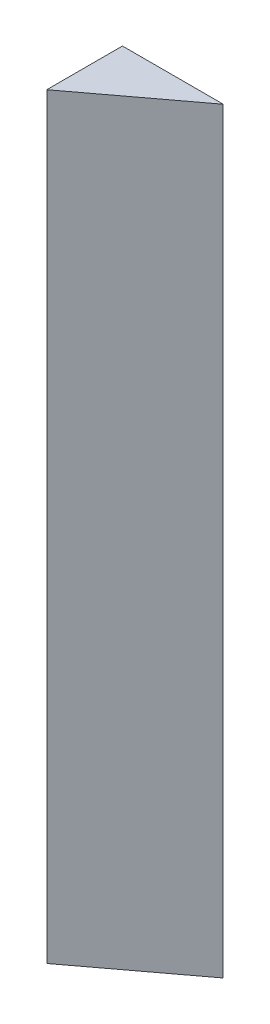
ISO-10303-21;
HEADER;
FILE_DESCRIPTION(('STEP AP214'),'2;1');
FILE_NAME('part.step','',(''),(''),'','','');
FILE_SCHEMA(('AUTOMOTIVE_DESIGN { 1 0 10303 214 1 1 1 1 }'));
ENDSEC;
DATA;
#1=APPLICATION_CONTEXT('core data for automotive mechanical design processes');
#2=APPLICATION_PROTOCOL_DEFINITION('international standard','automotive_design',2000,#1);
#3=PRODUCT_CONTEXT('',#1,'mechanical');
#4=PRODUCT('Part','Part','',(#3));
#5=PRODUCT_RELATED_PRODUCT_CATEGORY('part','',(#4));
#6=PRODUCT_DEFINITION_FORMATION('','',#4);
#7=PRODUCT_DEFINITION_CONTEXT('part definition',#1,'design');
#8=PRODUCT_DEFINITION('design','',#6,#7);
#9=PRODUCT_DEFINITION_SHAPE('','',#8);
#10=(LENGTH_UNIT() NAMED_UNIT(*) SI_UNIT(.MILLI.,.METRE.));
#11=(NAMED_UNIT(*) PLANE_ANGLE_UNIT() SI_UNIT($,.RADIAN.));
#12=(NAMED_UNIT(*) SI_UNIT($,.STERADIAN.) SOLID_ANGLE_UNIT());
#13=UNCERTAINTY_MEASURE_WITH_UNIT(LENGTH_MEASURE(1.E-05),#10,'distance_accuracy_value','');
#14=(GEOMETRIC_REPRESENTATION_CONTEXT(3) GLOBAL_UNCERTAINTY_ASSIGNED_CONTEXT((#13)) GLOBAL_UNIT_ASSIGNED_CONTEXT((#10,
#11,#12)) REPRESENTATION_CONTEXT('',''));
#15=CARTESIAN_POINT('',(0.,0.,0.));
#16=DIRECTION('',(0.,0.,1.));
#17=DIRECTION('',(1.,0.,0.));
#18=AXIS2_PLACEMENT_3D('',#15,#16,#17);
#19=CARTESIAN_POINT('',(-3.906661108733,-0.750000296654108,-2.35778269529518));
#20=DIRECTION('',(0.,-1.,-8.74227765734759E-08));
#21=DIRECTION('',(1.,0.,0.));
#22=AXIS2_PLACEMENT_3D('',#19,#20,#21);
#23=PLANE('',#22);
#24=DIRECTION('',(1.,0.,0.));
#25=VECTOR('',#24,1.);
#26=CARTESIAN_POINT('',(-3.9,-0.75000029723644,-2.35112158656318));
#27=LINE('',#26,#25);
#28=CARTESIAN_POINT('',(-3.9,-0.75000029723844,-2.35112158656318));
#29=VERTEX_POINT('',#28);
#30=CARTESIAN_POINT('',(-3.766777825356,-0.75000029723844,-2.35112158656318));
#31=VERTEX_POINT('',#30);
#32=EDGE_CURVE('E11',#29,#31,#27,.T.);
#33=ORIENTED_EDGE('',*,*,#32,.F.);
#34=DIRECTION('',(0.,8.74227767955204E-08,-0.999999999999996));
#35=VECTOR('',#34,1.);
#36=CARTESIAN_POINT('',(-3.9,-0.750000305978718,-2.25112158656318));
#37=LINE('',#36,#35);
#38=CARTESIAN_POINT('',(-3.9,-0.750000305980718,-2.25112158656318));
#39=VERTEX_POINT('',#38);
#40=EDGE_CURVE('E63',#39,#29,#37,.T.);
#41=ORIENTED_EDGE('',*,*,#40,.F.);
#42=DIRECTION('',(-0.799759704949036,-5.24816640793063E-08,0.600320259811234));
#43=VECTOR('',#42,1.);
#44=CARTESIAN_POINT('',(-3.766777825356,-0.75000029723644,-2.35112158656318));
#45=LINE('',#44,#43);
#46=EDGE_CURVE('E70',#31,#39,#45,.T.);
#47=ORIENTED_EDGE('',*,*,#46,.F.);
#48=EDGE_LOOP('',(#33,#41,#47));
#49=FACE_BOUND('',#48,.T.);
#50=ADVANCED_FACE('F17',(#49),#23,.F.);
#51=CARTESIAN_POINT('',(-3.906661108733,-1.75000029665511,-2.35778278271795));
#52=DIRECTION('',(0.,-1.,-8.74227765734759E-08));
#53=DIRECTION('',(1.,0.,0.));
#54=AXIS2_PLACEMENT_3D('',#51,#52,#53);
#55=PLANE('',#54);
#56=DIRECTION('',(-0.799759704949036,-5.24816634128169E-08,0.600320259811234));
#57=VECTOR('',#56,1.);
#58=CARTESIAN_POINT('',(-3.766777825356,-1.75000029723744,-2.35112167398595));
#59=LINE('',#58,#57);
#60=CARTESIAN_POINT('',(-3.766777825356,-1.75000029723644,-2.35112167398595));
#61=VERTEX_POINT('',#60);
#62=CARTESIAN_POINT('',(-3.9,-1.75000030597872,-2.25112167398595));
#63=VERTEX_POINT('',#62);
#64=EDGE_CURVE('E24',#61,#63,#59,.T.);
#65=ORIENTED_EDGE('',*,*,#64,.T.);
#66=DIRECTION('',(0.,8.7422775685297E-08,-0.999999999999996));
#67=VECTOR('',#66,1.);
#68=CARTESIAN_POINT('',(-3.9,-1.75000030597972,-2.25112167398595));
#69=LINE('',#68,#67);
#70=CARTESIAN_POINT('',(-3.9,-1.75000029723644,-2.35112167398595));
#71=VERTEX_POINT('',#70);
#72=EDGE_CURVE('E49',#63,#71,#69,.T.);
#73=ORIENTED_EDGE('',*,*,#72,.T.);
#74=DIRECTION('',(1.,0.,0.));
#75=VECTOR('',#74,1.);
#76=CARTESIAN_POINT('',(-3.9,-1.75000029723744,-2.35112167398595));
#77=LINE('',#76,#75);
#78=EDGE_CURVE('E46',#71,#61,#77,.T.);
#79=ORIENTED_EDGE('',*,*,#78,.T.);
#80=EDGE_LOOP('',(#65,#73,#79));
#81=FACE_BOUND('',#80,.T.);
#82=ADVANCED_FACE('F47',(#81),#55,.T.);
#83=CARTESIAN_POINT('',(-3.766777825356,-0.75000029723644,-2.35112158656318));
#84=DIRECTION('',(0.600320259811235,-6.99172139982287E-08,0.799759704949038));
#85=DIRECTION('',(-0.799759704949038,-5.24816639460086E-08,0.600320259811235));
#86=AXIS2_PLACEMENT_3D('',#83,#84,#85);
#87=PLANE('',#86);
#88=ORIENTED_EDGE('',*,*,#46,.T.);
#89=DIRECTION('',(0.,-0.999999999999996,-8.74227765733881E-08));
#90=VECTOR('',#89,1.);
#91=CARTESIAN_POINT('',(-3.9,-0.750000305978718,-2.25112158656318));
#92=LINE('',#91,#90);
#93=EDGE_CURVE('E54',#39,#63,#92,.T.);
#94=ORIENTED_EDGE('',*,*,#93,.T.);
#95=ORIENTED_EDGE('',*,*,#64,.F.);
#96=DIRECTION('',(0.,-0.999999999999996,-8.74227765733881E-08));
#97=VECTOR('',#96,1.);
#98=CARTESIAN_POINT('',(-3.766777825356,-0.75000029723644,-2.35112158656318));
#99=LINE('',#98,#97);
#100=EDGE_CURVE('E61',#31,#61,#99,.T.);
#101=ORIENTED_EDGE('',*,*,#100,.F.);
#102=EDGE_LOOP('',(#88,#94,#95,#101));
#103=FACE_BOUND('',#102,.T.);
#104=ADVANCED_FACE('F60',(#103),#87,.T.);
#105=CARTESIAN_POINT('',(-3.9,-0.750000305978718,-2.25112158656318));
#106=DIRECTION('',(-1.,0.,0.));
#107=DIRECTION('',(0.,8.74227765734759E-08,-1.));
#108=AXIS2_PLACEMENT_3D('',#105,#106,#107);
#109=PLANE('',#108);
#110=ORIENTED_EDGE('',*,*,#40,.T.);
#111=DIRECTION('',(0.,-0.999999999999996,-8.74227765733881E-08));
#112=VECTOR('',#111,1.);
#113=CARTESIAN_POINT('',(-3.9,-0.75000029723644,-2.35112158656318));
#114=LINE('',#113,#112);
#115=EDGE_CURVE('E55',#29,#71,#114,.T.);
#116=ORIENTED_EDGE('',*,*,#115,.T.);
#117=ORIENTED_EDGE('',*,*,#72,.F.);
#118=ORIENTED_EDGE('',*,*,#93,.F.);
#119=EDGE_LOOP('',(#110,#116,#117,#118));
#120=FACE_BOUND('',#119,.T.);
#121=ADVANCED_FACE('F73',(#120),#109,.T.);
#122=CARTESIAN_POINT('',(-3.9,-0.75000029723644,-2.35112158656318));
#123=DIRECTION('',(0.,8.74227765734759E-08,-1.));
#124=DIRECTION('',(1.,0.,0.));
#125=AXIS2_PLACEMENT_3D('',#122,#123,#124);
#126=PLANE('',#125);
#127=ORIENTED_EDGE('',*,*,#32,.T.);
#128=ORIENTED_EDGE('',*,*,#100,.T.);
#129=ORIENTED_EDGE('',*,*,#78,.F.);
#130=ORIENTED_EDGE('',*,*,#115,.F.);
#131=EDGE_LOOP('',(#127,#128,#129,#130));
#132=FACE_BOUND('',#131,.T.);
#133=ADVANCED_FACE('F64',(#132),#126,.T.);
#134=CLOSED_SHELL('',(#50,#82,#104,#121,#133));
#135=MANIFOLD_SOLID_BREP('B1',#134);
#136=ADVANCED_BREP_SHAPE_REPRESENTATION('',(#18,#135),#14);
#137=SHAPE_DEFINITION_REPRESENTATION(#9,#136);
ENDSEC;
END-ISO-10303-21;
